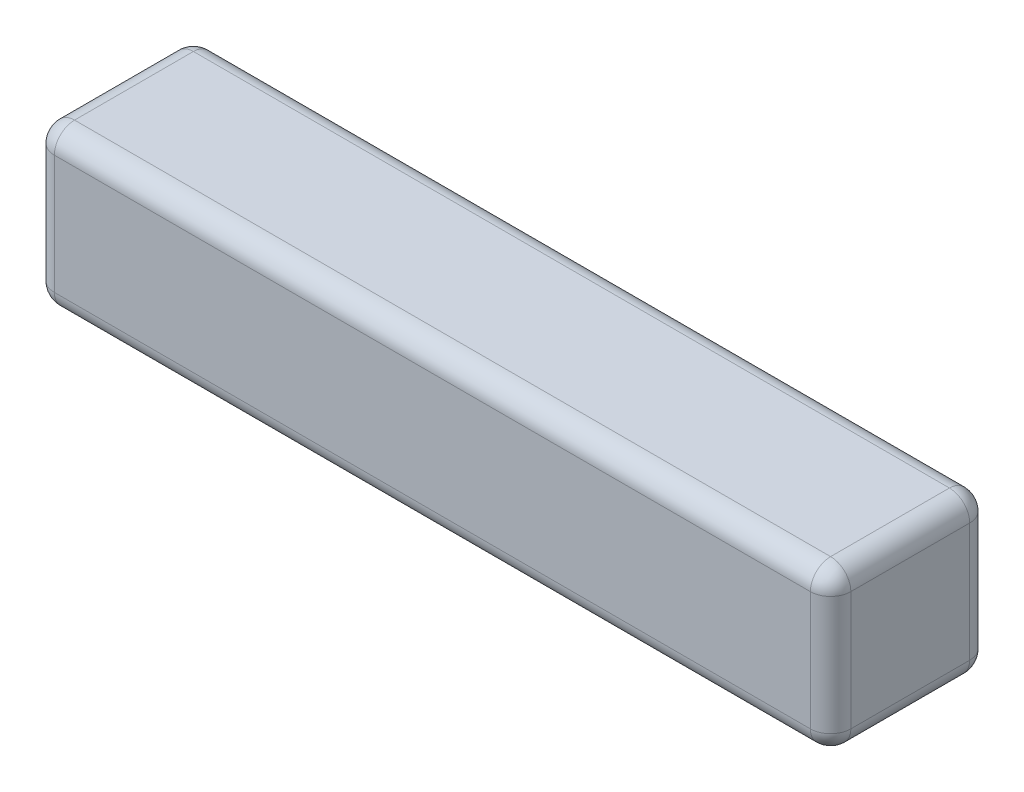
ISO-10303-21;
HEADER;
FILE_DESCRIPTION(('STEP AP214'),'2;1');
FILE_NAME('part.step','',(''),(''),'','','');
FILE_SCHEMA(('AUTOMOTIVE_DESIGN { 1 0 10303 214 1 1 1 1 }'));
ENDSEC;
DATA;
#1=APPLICATION_CONTEXT('core data for automotive mechanical design processes');
#2=APPLICATION_PROTOCOL_DEFINITION('international standard','automotive_design',2000,#1);
#3=PRODUCT_CONTEXT('',#1,'mechanical');
#4=PRODUCT('Part','Part','',(#3));
#5=PRODUCT_RELATED_PRODUCT_CATEGORY('part','',(#4));
#6=PRODUCT_DEFINITION_FORMATION('','',#4);
#7=PRODUCT_DEFINITION_CONTEXT('part definition',#1,'design');
#8=PRODUCT_DEFINITION('design','',#6,#7);
#9=PRODUCT_DEFINITION_SHAPE('','',#8);
#10=(LENGTH_UNIT() NAMED_UNIT(*) SI_UNIT(.MILLI.,.METRE.));
#11=(NAMED_UNIT(*) PLANE_ANGLE_UNIT() SI_UNIT($,.RADIAN.));
#12=(NAMED_UNIT(*) SI_UNIT($,.STERADIAN.) SOLID_ANGLE_UNIT());
#13=UNCERTAINTY_MEASURE_WITH_UNIT(LENGTH_MEASURE(1.E-05),#10,'distance_accuracy_value','');
#14=(GEOMETRIC_REPRESENTATION_CONTEXT(3) GLOBAL_UNCERTAINTY_ASSIGNED_CONTEXT((#13)) GLOBAL_UNIT_ASSIGNED_CONTEXT((#10,
#11,#12)) REPRESENTATION_CONTEXT('',''));
#15=CARTESIAN_POINT('',(0.,0.,0.));
#16=DIRECTION('',(0.,0.,1.));
#17=DIRECTION('',(1.,0.,0.));
#18=AXIS2_PLACEMENT_3D('',#15,#16,#17);
#19=CARTESIAN_POINT('',(9.746,-21.0707501147141,-3.74600000000002));
#20=DIRECTION('',(1.,0.,0.));
#21=DIRECTION('',(0.,0.,-1.));
#22=AXIS2_PLACEMENT_3D('',#19,#20,#21);
#23=SPHERICAL_SURFACE('',#22,0.254);
#24=CARTESIAN_POINT('',(9.746,-21.0707501147141,-3.74600000000002));
#25=DIRECTION('',(0.,0.,-1.));
#26=DIRECTION('',(0.,1.,0.));
#27=AXIS2_PLACEMENT_3D('',#24,#25,#26);
#28=CIRCLE('',#27,0.254000000000001);
#29=CARTESIAN_POINT('',(10.,-21.0707501147141,-3.74600000000002));
#30=VERTEX_POINT('',#29);
#31=CARTESIAN_POINT('',(9.746,-20.8167501147141,-3.74600000000001));
#32=VERTEX_POINT('',#31);
#33=EDGE_CURVE('E296',#30,#32,#28,.F.);
#34=ORIENTED_EDGE('',*,*,#33,.F.);
#35=CARTESIAN_POINT('',(9.746,-21.0707501147141,-3.74600000000001));
#36=DIRECTION('',(0.,-1.,0.));
#37=DIRECTION('',(0.,0.,-1.));
#38=AXIS2_PLACEMENT_3D('',#35,#36,#37);
#39=CIRCLE('',#38,0.254);
#40=CARTESIAN_POINT('',(9.746,-21.0707501147141,-4.00000000000002));
#41=VERTEX_POINT('',#40);
#42=EDGE_CURVE('E133',#41,#30,#39,.T.);
#43=ORIENTED_EDGE('',*,*,#42,.F.);
#44=CARTESIAN_POINT('',(9.746,-21.0707501147141,-3.74600000000002));
#45=DIRECTION('',(-1.,0.,0.));
#46=DIRECTION('',(0.,0.,1.));
#47=AXIS2_PLACEMENT_3D('',#44,#45,#46);
#48=CIRCLE('',#47,0.254);
#49=EDGE_CURVE('E103',#32,#41,#48,.T.);
#50=ORIENTED_EDGE('',*,*,#49,.F.);
#51=EDGE_LOOP('',(#34,#43,#50));
#52=FACE_BOUND('',#51,.T.);
#53=ADVANCED_FACE('F16',(#52),#23,.T.);
#54=CARTESIAN_POINT('',(9.746,-22.5627501147141,-3.74600000000002));
#55=DIRECTION('',(1.,0.,0.));
#56=DIRECTION('',(0.,0.,-1.));
#57=AXIS2_PLACEMENT_3D('',#54,#55,#56);
#58=SPHERICAL_SURFACE('',#57,0.254);
#59=CARTESIAN_POINT('',(9.746,-22.5627501147141,-3.74600000000001));
#60=DIRECTION('',(0.,0.,1.));
#61=DIRECTION('',(0.,-1.,0.));
#62=AXIS2_PLACEMENT_3D('',#59,#60,#61);
#63=CIRCLE('',#62,0.254000000000001);
#64=CARTESIAN_POINT('',(9.746,-22.8167501147141,-3.74600000000001));
#65=VERTEX_POINT('',#64);
#66=CARTESIAN_POINT('',(10.,-22.5627501147141,-3.74600000000002));
#67=VERTEX_POINT('',#66);
#68=EDGE_CURVE('E288',#65,#67,#63,.T.);
#69=ORIENTED_EDGE('',*,*,#68,.F.);
#70=CARTESIAN_POINT('',(9.746,-22.5627501147141,-3.74600000000002));
#71=DIRECTION('',(-1.,0.,0.));
#72=DIRECTION('',(0.,0.,1.));
#73=AXIS2_PLACEMENT_3D('',#70,#71,#72);
#74=CIRCLE('',#73,0.254);
#75=CARTESIAN_POINT('',(9.746,-22.5627501147141,-4.00000000000001));
#76=VERTEX_POINT('',#75);
#77=EDGE_CURVE('E287',#76,#65,#74,.T.);
#78=ORIENTED_EDGE('',*,*,#77,.F.);
#79=CARTESIAN_POINT('',(9.746,-22.5627501147141,-3.74600000000001));
#80=DIRECTION('',(0.,-1.,0.));
#81=DIRECTION('',(0.,0.,-1.));
#82=AXIS2_PLACEMENT_3D('',#79,#80,#81);
#83=CIRCLE('',#82,0.254);
#84=EDGE_CURVE('E283',#67,#76,#83,.F.);
#85=ORIENTED_EDGE('',*,*,#84,.F.);
#86=EDGE_LOOP('',(#69,#78,#85));
#87=FACE_BOUND('',#86,.T.);
#88=ADVANCED_FACE('F154',(#87),#58,.T.);
#89=CARTESIAN_POINT('',(10.,-20.8167501147141,-4.00000000000002));
#90=DIRECTION('',(0.,0.,1.));
#91=DIRECTION('',(0.,-1.,0.));
#92=AXIS2_PLACEMENT_3D('',#89,#90,#91);
#93=PLANE('',#92);
#94=DIRECTION('',(-1.,0.,0.));
#95=VECTOR('',#94,1.);
#96=CARTESIAN_POINT('',(10.,-22.5627501147141,-4.00000000000002));
#97=LINE('',#96,#95);
#98=CARTESIAN_POINT('',(0.254000000000004,-22.5627501147141,-4.00000000000002));
#99=VERTEX_POINT('',#98);
#100=EDGE_CURVE('E116',#99,#76,#97,.F.);
#101=ORIENTED_EDGE('',*,*,#100,.F.);
#102=DIRECTION('',(0.,-1.,0.));
#103=VECTOR('',#102,1.);
#104=CARTESIAN_POINT('',(0.254000000000004,-20.8167501147141,-4.00000000000002));
#105=LINE('',#104,#103);
#106=CARTESIAN_POINT('',(0.254000000000004,-21.0707501147141,-4.00000000000002));
#107=VERTEX_POINT('',#106);
#108=EDGE_CURVE('E110',#107,#99,#105,.T.);
#109=ORIENTED_EDGE('',*,*,#108,.F.);
#110=DIRECTION('',(-1.,0.,0.));
#111=VECTOR('',#110,1.);
#112=CARTESIAN_POINT('',(10.,-21.0707501147141,-4.00000000000002));
#113=LINE('',#112,#111);
#114=EDGE_CURVE('E114',#41,#107,#113,.T.);
#115=ORIENTED_EDGE('',*,*,#114,.F.);
#116=DIRECTION('',(0.,-1.,0.));
#117=VECTOR('',#116,1.);
#118=CARTESIAN_POINT('',(9.746,-22.8167501147141,-4.00000000000001));
#119=LINE('',#118,#117);
#120=EDGE_CURVE('E285',#76,#41,#119,.F.);
#121=ORIENTED_EDGE('',*,*,#120,.F.);
#122=EDGE_LOOP('',(#101,#109,#115,#121));
#123=FACE_BOUND('',#122,.T.);
#124=ADVANCED_FACE('F112',(#123),#93,.F.);
#125=CARTESIAN_POINT('',(0.254000000000004,-21.0707501147141,-3.74600000000002));
#126=DIRECTION('',(1.,0.,0.));
#127=DIRECTION('',(0.,0.,-1.));
#128=AXIS2_PLACEMENT_3D('',#125,#126,#127);
#129=SPHERICAL_SURFACE('',#128,0.254);
#130=CARTESIAN_POINT('',(0.254000000000004,-21.0707501147141,-3.74600000000002));
#131=DIRECTION('',(-1.,0.,0.));
#132=DIRECTION('',(0.,0.,1.));
#133=AXIS2_PLACEMENT_3D('',#130,#131,#132);
#134=CIRCLE('',#133,0.254);
#135=CARTESIAN_POINT('',(0.254000000000004,-20.8167501147141,-3.74600000000001));
#136=VERTEX_POINT('',#135);
#137=EDGE_CURVE('E118',#107,#136,#134,.F.);
#138=ORIENTED_EDGE('',*,*,#137,.F.);
#139=CARTESIAN_POINT('',(0.254000000000004,-21.0707501147141,-3.74600000000001));
#140=DIRECTION('',(0.,1.,0.));
#141=DIRECTION('',(0.,0.,1.));
#142=AXIS2_PLACEMENT_3D('',#139,#140,#141);
#143=CIRCLE('',#142,0.254);
#144=CARTESIAN_POINT('',(0.,-21.0707501147141,-3.74600000000001));
#145=VERTEX_POINT('',#144);
#146=EDGE_CURVE('E122',#145,#107,#143,.F.);
#147=ORIENTED_EDGE('',*,*,#146,.F.);
#148=CARTESIAN_POINT('',(0.254000000000004,-21.0707501147141,-3.74600000000001));
#149=DIRECTION('',(0.,0.,1.));
#150=DIRECTION('',(0.,-1.,0.));
#151=AXIS2_PLACEMENT_3D('',#148,#149,#150);
#152=CIRCLE('',#151,0.254);
#153=EDGE_CURVE('E136',#136,#145,#152,.T.);
#154=ORIENTED_EDGE('',*,*,#153,.F.);
#155=EDGE_LOOP('',(#138,#147,#154));
#156=FACE_BOUND('',#155,.T.);
#157=ADVANCED_FACE('F135',(#156),#129,.T.);
#158=CARTESIAN_POINT('',(0.254000000000004,-22.5627501147141,-3.74600000000002));
#159=DIRECTION('',(1.,0.,0.));
#160=DIRECTION('',(0.,0.,-1.));
#161=AXIS2_PLACEMENT_3D('',#158,#159,#160);
#162=SPHERICAL_SURFACE('',#161,0.254);
#163=CARTESIAN_POINT('',(0.254000000000004,-22.5627501147141,-3.74600000000001));
#164=DIRECTION('',(0.,1.,0.));
#165=DIRECTION('',(0.,0.,1.));
#166=AXIS2_PLACEMENT_3D('',#163,#164,#165);
#167=CIRCLE('',#166,0.254);
#168=CARTESIAN_POINT('',(0.,-22.5627501147141,-3.74600000000002));
#169=VERTEX_POINT('',#168);
#170=EDGE_CURVE('E129',#99,#169,#167,.T.);
#171=ORIENTED_EDGE('',*,*,#170,.F.);
#172=CARTESIAN_POINT('',(0.254000000000004,-22.5627501147141,-3.74600000000002));
#173=DIRECTION('',(-1.,0.,0.));
#174=DIRECTION('',(0.,0.,1.));
#175=AXIS2_PLACEMENT_3D('',#172,#173,#174);
#176=CIRCLE('',#175,0.254);
#177=CARTESIAN_POINT('',(0.254000000000004,-22.8167501147141,-3.74600000000001));
#178=VERTEX_POINT('',#177);
#179=EDGE_CURVE('E291',#178,#99,#176,.F.);
#180=ORIENTED_EDGE('',*,*,#179,.F.);
#181=CARTESIAN_POINT('',(0.254000000000004,-22.5627501147141,-3.74600000000002));
#182=DIRECTION('',(0.,0.,-1.));
#183=DIRECTION('',(0.,1.,0.));
#184=AXIS2_PLACEMENT_3D('',#181,#182,#183);
#185=CIRCLE('',#184,0.254);
#186=EDGE_CURVE('E130',#169,#178,#185,.F.);
#187=ORIENTED_EDGE('',*,*,#186,.F.);
#188=EDGE_LOOP('',(#171,#180,#187));
#189=FACE_BOUND('',#188,.T.);
#190=ADVANCED_FACE('F145',(#189),#162,.T.);
#191=CARTESIAN_POINT('',(10.,-21.0707501147141,-3.74600000000002));
#192=DIRECTION('',(-1.,0.,0.));
#193=DIRECTION('',(0.,0.,1.));
#194=AXIS2_PLACEMENT_3D('',#191,#192,#193);
#195=CYLINDRICAL_SURFACE('',#194,0.254);
#196=ORIENTED_EDGE('',*,*,#49,.T.);
#197=ORIENTED_EDGE('',*,*,#114,.T.);
#198=ORIENTED_EDGE('',*,*,#137,.T.);
#199=DIRECTION('',(1.,0.,0.));
#200=VECTOR('',#199,1.);
#201=CARTESIAN_POINT('',(10.,-20.8167501147141,-3.74600000000001));
#202=LINE('',#201,#200);
#203=EDGE_CURVE('E378',#136,#32,#202,.T.);
#204=ORIENTED_EDGE('',*,*,#203,.T.);
#205=EDGE_LOOP('',(#196,#197,#198,#204));
#206=FACE_BOUND('',#205,.T.);
#207=ADVANCED_FACE('F132',(#206),#195,.T.);
#208=CARTESIAN_POINT('',(9.746,-22.8167501147141,-3.74600000000001));
#209=DIRECTION('',(0.,-1.,0.));
#210=DIRECTION('',(0.,0.,-1.));
#211=AXIS2_PLACEMENT_3D('',#208,#209,#210);
#212=CYLINDRICAL_SURFACE('',#211,0.254);
#213=ORIENTED_EDGE('',*,*,#84,.T.);
#214=ORIENTED_EDGE('',*,*,#120,.T.);
#215=ORIENTED_EDGE('',*,*,#42,.T.);
#216=DIRECTION('',(0.,1.,0.));
#217=VECTOR('',#216,1.);
#218=CARTESIAN_POINT('',(10.,-22.8167501147141,-3.74600000000002));
#219=LINE('',#218,#217);
#220=EDGE_CURVE('E235',#67,#30,#219,.T.);
#221=ORIENTED_EDGE('',*,*,#220,.F.);
#222=EDGE_LOOP('',(#213,#214,#215,#221));
#223=FACE_BOUND('',#222,.T.);
#224=ADVANCED_FACE('F273',(#223),#212,.T.);
#225=CARTESIAN_POINT('',(9.746,-21.0707501147141,-2.00000000000002));
#226=DIRECTION('',(0.,0.,-1.));
#227=DIRECTION('',(0.,1.,0.));
#228=AXIS2_PLACEMENT_3D('',#225,#226,#227);
#229=CYLINDRICAL_SURFACE('',#228,0.254000000000001);
#230=ORIENTED_EDGE('',*,*,#33,.T.);
#231=DIRECTION('',(0.,0.,-1.));
#232=VECTOR('',#231,1.);
#233=CARTESIAN_POINT('',(9.746,-20.8167501147141,-2.00000000000002));
#234=LINE('',#233,#232);
#235=CARTESIAN_POINT('',(9.746,-20.8167501147141,-2.25400000000001));
#236=VERTEX_POINT('',#235);
#237=EDGE_CURVE('E310',#32,#236,#234,.F.);
#238=ORIENTED_EDGE('',*,*,#237,.T.);
#239=CARTESIAN_POINT('',(9.746,-21.0707501147141,-2.25400000000001));
#240=DIRECTION('',(0.,0.,1.));
#241=DIRECTION('',(1.,0.,0.));
#242=AXIS2_PLACEMENT_3D('',#239,#240,#241);
#243=CIRCLE('',#242,0.254);
#244=CARTESIAN_POINT('',(10.,-21.0707501147141,-2.25400000000001));
#245=VERTEX_POINT('',#244);
#246=EDGE_CURVE('E241',#245,#236,#243,.T.);
#247=ORIENTED_EDGE('',*,*,#246,.F.);
#248=DIRECTION('',(0.,0.,-1.));
#249=VECTOR('',#248,1.);
#250=CARTESIAN_POINT('',(10.,-21.0707501147141,-2.00000000000001));
#251=LINE('',#250,#249);
#252=EDGE_CURVE('E233',#30,#245,#251,.F.);
#253=ORIENTED_EDGE('',*,*,#252,.F.);
#254=EDGE_LOOP('',(#230,#238,#247,#253));
#255=FACE_BOUND('',#254,.T.);
#256=ADVANCED_FACE('F270',(#255),#229,.T.);
#257=CARTESIAN_POINT('',(9.746,-22.5627501147141,-2.00000000000001));
#258=DIRECTION('',(0.,0.,1.));
#259=DIRECTION('',(0.,-1.,0.));
#260=AXIS2_PLACEMENT_3D('',#257,#258,#259);
#261=CYLINDRICAL_SURFACE('',#260,0.254000000000001);
#262=ORIENTED_EDGE('',*,*,#68,.T.);
#263=DIRECTION('',(0.,0.,-1.));
#264=VECTOR('',#263,1.);
#265=CARTESIAN_POINT('',(10.,-22.5627501147141,-2.00000000000001));
#266=LINE('',#265,#264);
#267=CARTESIAN_POINT('',(10.,-22.5627501147141,-2.25400000000001));
#268=VERTEX_POINT('',#267);
#269=EDGE_CURVE('E238',#268,#67,#266,.T.);
#270=ORIENTED_EDGE('',*,*,#269,.F.);
#271=CARTESIAN_POINT('',(9.746,-22.5627501147141,-2.25400000000001));
#272=DIRECTION('',(0.,0.,-1.));
#273=DIRECTION('',(1.,0.,0.));
#274=AXIS2_PLACEMENT_3D('',#271,#272,#273);
#275=CIRCLE('',#274,0.254);
#276=CARTESIAN_POINT('',(9.746,-22.8167501147141,-2.25400000000001));
#277=VERTEX_POINT('',#276);
#278=EDGE_CURVE('E231',#277,#268,#275,.F.);
#279=ORIENTED_EDGE('',*,*,#278,.F.);
#280=DIRECTION('',(0.,0.,1.));
#281=VECTOR('',#280,1.);
#282=CARTESIAN_POINT('',(9.746,-22.8167501147141,-2.00000000000001));
#283=LINE('',#282,#281);
#284=EDGE_CURVE('E229',#277,#65,#283,.F.);
#285=ORIENTED_EDGE('',*,*,#284,.T.);
#286=EDGE_LOOP('',(#262,#270,#279,#285));
#287=FACE_BOUND('',#286,.T.);
#288=ADVANCED_FACE('F266',(#287),#261,.T.);
#289=CARTESIAN_POINT('',(10.,-22.5627501147141,-3.74600000000002));
#290=DIRECTION('',(-1.,0.,0.));
#291=DIRECTION('',(0.,0.,1.));
#292=AXIS2_PLACEMENT_3D('',#289,#290,#291);
#293=CYLINDRICAL_SURFACE('',#292,0.254);
#294=ORIENTED_EDGE('',*,*,#179,.T.);
#295=ORIENTED_EDGE('',*,*,#100,.T.);
#296=ORIENTED_EDGE('',*,*,#77,.T.);
#297=DIRECTION('',(1.,0.,0.));
#298=VECTOR('',#297,1.);
#299=CARTESIAN_POINT('',(10.,-22.8167501147141,-3.74600000000001));
#300=LINE('',#299,#298);
#301=EDGE_CURVE('E373',#65,#178,#300,.F.);
#302=ORIENTED_EDGE('',*,*,#301,.T.);
#303=EDGE_LOOP('',(#294,#295,#296,#302));
#304=FACE_BOUND('',#303,.T.);
#305=ADVANCED_FACE('F262',(#304),#293,.T.);
#306=CARTESIAN_POINT('',(0.254000000000004,-21.0707501147141,-2.00000000000002));
#307=DIRECTION('',(0.,0.,1.));
#308=DIRECTION('',(0.,-1.,0.));
#309=AXIS2_PLACEMENT_3D('',#306,#307,#308);
#310=CYLINDRICAL_SURFACE('',#309,0.254);
#311=ORIENTED_EDGE('',*,*,#153,.T.);
#312=DIRECTION('',(0.,0.,-1.));
#313=VECTOR('',#312,1.);
#314=CARTESIAN_POINT('',(0.,-21.0707501147141,-2.00000000000001));
#315=LINE('',#314,#313);
#316=CARTESIAN_POINT('',(0.,-21.0707501147141,-2.25400000000001));
#317=VERTEX_POINT('',#316);
#318=EDGE_CURVE('E204',#145,#317,#315,.F.);
#319=ORIENTED_EDGE('',*,*,#318,.T.);
#320=CARTESIAN_POINT('',(0.254000000000004,-21.0707501147141,-2.25400000000001));
#321=DIRECTION('',(0.,0.,1.));
#322=DIRECTION('',(1.,0.,0.));
#323=AXIS2_PLACEMENT_3D('',#320,#321,#322);
#324=CIRCLE('',#323,0.254);
#325=CARTESIAN_POINT('',(0.254000000000004,-20.8167501147141,-2.25400000000001));
#326=VERTEX_POINT('',#325);
#327=EDGE_CURVE('E207',#326,#317,#324,.T.);
#328=ORIENTED_EDGE('',*,*,#327,.F.);
#329=DIRECTION('',(0.,0.,-1.));
#330=VECTOR('',#329,1.);
#331=CARTESIAN_POINT('',(0.254000000000004,-20.8167501147141,-2.00000000000002));
#332=LINE('',#331,#330);
#333=EDGE_CURVE('E376',#326,#136,#332,.T.);
#334=ORIENTED_EDGE('',*,*,#333,.T.);
#335=EDGE_LOOP('',(#311,#319,#328,#334));
#336=FACE_BOUND('',#335,.T.);
#337=ADVANCED_FACE('F258',(#336),#310,.T.);
#338=CARTESIAN_POINT('',(0.254000000000004,-22.5627501147141,-2.00000000000001));
#339=DIRECTION('',(0.,0.,-1.));
#340=DIRECTION('',(0.,1.,0.));
#341=AXIS2_PLACEMENT_3D('',#338,#339,#340);
#342=CYLINDRICAL_SURFACE('',#341,0.254);
#343=ORIENTED_EDGE('',*,*,#186,.T.);
#344=DIRECTION('',(0.,0.,1.));
#345=VECTOR('',#344,1.);
#346=CARTESIAN_POINT('',(0.254000000000004,-22.8167501147141,-2.00000000000001));
#347=LINE('',#346,#345);
#348=CARTESIAN_POINT('',(0.254000000000004,-22.8167501147141,-2.25400000000001));
#349=VERTEX_POINT('',#348);
#350=EDGE_CURVE('E367',#178,#349,#347,.T.);
#351=ORIENTED_EDGE('',*,*,#350,.T.);
#352=CARTESIAN_POINT('',(0.254000000000004,-22.5627501147141,-2.25400000000001));
#353=DIRECTION('',(0.,0.,-1.));
#354=DIRECTION('',(0.,1.,0.));
#355=AXIS2_PLACEMENT_3D('',#352,#353,#354);
#356=CIRCLE('',#355,0.254);
#357=CARTESIAN_POINT('',(0.,-22.5627501147141,-2.25400000000001));
#358=VERTEX_POINT('',#357);
#359=EDGE_CURVE('E365',#349,#358,#356,.T.);
#360=ORIENTED_EDGE('',*,*,#359,.T.);
#361=DIRECTION('',(0.,0.,-1.));
#362=VECTOR('',#361,1.);
#363=CARTESIAN_POINT('',(0.,-22.5627501147141,-2.00000000000001));
#364=LINE('',#363,#362);
#365=EDGE_CURVE('E201',#358,#169,#364,.T.);
#366=ORIENTED_EDGE('',*,*,#365,.T.);
#367=EDGE_LOOP('',(#343,#351,#360,#366));
#368=FACE_BOUND('',#367,.T.);
#369=ADVANCED_FACE('F255',(#368),#342,.T.);
#370=CARTESIAN_POINT('',(0.254000000000004,-20.8167501147141,-3.74600000000001));
#371=DIRECTION('',(0.,1.,0.));
#372=DIRECTION('',(0.,0.,1.));
#373=AXIS2_PLACEMENT_3D('',#370,#371,#372);
#374=CYLINDRICAL_SURFACE('',#373,0.254);
#375=ORIENTED_EDGE('',*,*,#170,.T.);
#376=DIRECTION('',(0.,1.,0.));
#377=VECTOR('',#376,1.);
#378=CARTESIAN_POINT('',(0.,-22.8167501147141,-3.74600000000002));
#379=LINE('',#378,#377);
#380=EDGE_CURVE('E125',#169,#145,#379,.T.);
#381=ORIENTED_EDGE('',*,*,#380,.T.);
#382=ORIENTED_EDGE('',*,*,#146,.T.);
#383=ORIENTED_EDGE('',*,*,#108,.T.);
#384=EDGE_LOOP('',(#375,#381,#382,#383));
#385=FACE_BOUND('',#384,.T.);
#386=ADVANCED_FACE('F123',(#385),#374,.T.);
#387=CARTESIAN_POINT('',(10.,-20.8167501147141,-2.00000000000002));
#388=DIRECTION('',(0.,-1.,0.));
#389=DIRECTION('',(0.,0.,-1.));
#390=AXIS2_PLACEMENT_3D('',#387,#388,#389);
#391=PLANE('',#390);
#392=ORIENTED_EDGE('',*,*,#203,.F.);
#393=ORIENTED_EDGE('',*,*,#333,.F.);
#394=DIRECTION('',(-1.,0.,0.));
#395=VECTOR('',#394,1.);
#396=CARTESIAN_POINT('',(10.,-20.8167501147141,-2.25400000000002));
#397=LINE('',#396,#395);
#398=EDGE_CURVE('E327',#236,#326,#397,.T.);
#399=ORIENTED_EDGE('',*,*,#398,.F.);
#400=ORIENTED_EDGE('',*,*,#237,.F.);
#401=EDGE_LOOP('',(#392,#393,#399,#400));
#402=FACE_BOUND('',#401,.T.);
#403=ADVANCED_FACE('F248',(#402),#391,.F.);
#404=CARTESIAN_POINT('',(9.746,-21.0707501147141,-2.25400000000001));
#405=DIRECTION('',(1.,0.,0.));
#406=DIRECTION('',(0.,0.,-1.));
#407=AXIS2_PLACEMENT_3D('',#404,#405,#406);
#408=SPHERICAL_SURFACE('',#407,0.254);
#409=CARTESIAN_POINT('',(9.746,-21.0707501147141,-2.25400000000001));
#410=DIRECTION('',(-1.,0.,0.));
#411=DIRECTION('',(0.,0.,1.));
#412=AXIS2_PLACEMENT_3D('',#409,#410,#411);
#413=CIRCLE('',#412,0.254);
#414=CARTESIAN_POINT('',(9.746,-21.0707501147141,-2.00000000000001));
#415=VERTEX_POINT('',#414);
#416=EDGE_CURVE('E198',#415,#236,#413,.T.);
#417=ORIENTED_EDGE('',*,*,#416,.F.);
#418=CARTESIAN_POINT('',(9.746,-21.0707501147141,-2.25400000000001));
#419=DIRECTION('',(0.,1.,0.));
#420=DIRECTION('',(0.,0.,1.));
#421=AXIS2_PLACEMENT_3D('',#418,#419,#420);
#422=CIRCLE('',#421,0.254);
#423=EDGE_CURVE('E318',#245,#415,#422,.F.);
#424=ORIENTED_EDGE('',*,*,#423,.F.);
#425=ORIENTED_EDGE('',*,*,#246,.T.);
#426=EDGE_LOOP('',(#417,#424,#425));
#427=FACE_BOUND('',#426,.T.);
#428=ADVANCED_FACE('F245',(#427),#408,.T.);
#429=CARTESIAN_POINT('',(10.,-22.8167501147141,-2.00000000000001));
#430=DIRECTION('',(1.,0.,0.));
#431=DIRECTION('',(0.,0.,-1.));
#432=AXIS2_PLACEMENT_3D('',#429,#430,#431);
#433=PLANE('',#432);
#434=ORIENTED_EDGE('',*,*,#252,.T.);
#435=DIRECTION('',(0.,1.,0.));
#436=VECTOR('',#435,1.);
#437=CARTESIAN_POINT('',(10.,-22.8167501147141,-2.25400000000001));
#438=LINE('',#437,#436);
#439=EDGE_CURVE('E316',#268,#245,#438,.T.);
#440=ORIENTED_EDGE('',*,*,#439,.F.);
#441=ORIENTED_EDGE('',*,*,#269,.T.);
#442=ORIENTED_EDGE('',*,*,#220,.T.);
#443=EDGE_LOOP('',(#434,#440,#441,#442));
#444=FACE_BOUND('',#443,.T.);
#445=ADVANCED_FACE('F223',(#444),#433,.T.);
#446=CARTESIAN_POINT('',(9.746,-22.5627501147141,-2.25400000000001));
#447=DIRECTION('',(1.,0.,0.));
#448=DIRECTION('',(0.,0.,-1.));
#449=AXIS2_PLACEMENT_3D('',#446,#447,#448);
#450=SPHERICAL_SURFACE('',#449,0.254);
#451=CARTESIAN_POINT('',(9.746,-22.5627501147141,-2.25400000000001));
#452=DIRECTION('',(-1.,0.,0.));
#453=DIRECTION('',(0.,0.,1.));
#454=AXIS2_PLACEMENT_3D('',#451,#452,#453);
#455=CIRCLE('',#454,0.254);
#456=CARTESIAN_POINT('',(9.746,-22.5627501147018,-2.00000000000001));
#457=VERTEX_POINT('',#456);
#458=EDGE_CURVE('E321',#277,#457,#455,.T.);
#459=ORIENTED_EDGE('',*,*,#458,.F.);
#460=ORIENTED_EDGE('',*,*,#278,.T.);
#461=CARTESIAN_POINT('',(9.746,-22.5627501147141,-2.25400000000001));
#462=DIRECTION('',(0.,1.,0.));
#463=DIRECTION('',(0.,0.,1.));
#464=AXIS2_PLACEMENT_3D('',#461,#462,#463);
#465=CIRCLE('',#464,0.254);
#466=EDGE_CURVE('E320',#457,#268,#465,.T.);
#467=ORIENTED_EDGE('',*,*,#466,.F.);
#468=EDGE_LOOP('',(#459,#460,#467));
#469=FACE_BOUND('',#468,.T.);
#470=ADVANCED_FACE('F218',(#469),#450,.T.);
#471=CARTESIAN_POINT('',(10.,-22.8167501147141,-2.00000000000001));
#472=DIRECTION('',(0.,1.,0.));
#473=DIRECTION('',(0.,0.,1.));
#474=AXIS2_PLACEMENT_3D('',#471,#472,#473);
#475=PLANE('',#474);
#476=ORIENTED_EDGE('',*,*,#301,.F.);
#477=ORIENTED_EDGE('',*,*,#284,.F.);
#478=DIRECTION('',(-1.,0.,0.));
#479=VECTOR('',#478,1.);
#480=CARTESIAN_POINT('',(10.,-22.8167501147141,-2.25400000000001));
#481=LINE('',#480,#479);
#482=EDGE_CURVE('E348',#349,#277,#481,.F.);
#483=ORIENTED_EDGE('',*,*,#482,.F.);
#484=ORIENTED_EDGE('',*,*,#350,.F.);
#485=EDGE_LOOP('',(#476,#477,#483,#484));
#486=FACE_BOUND('',#485,.T.);
#487=ADVANCED_FACE('F214',(#486),#475,.F.);
#488=CARTESIAN_POINT('',(0.254000000000004,-21.0707501147141,-2.25400000000001));
#489=DIRECTION('',(1.,0.,0.));
#490=DIRECTION('',(0.,0.,-1.));
#491=AXIS2_PLACEMENT_3D('',#488,#489,#490);
#492=SPHERICAL_SURFACE('',#491,0.254);
#493=CARTESIAN_POINT('',(0.254000000000004,-21.0707501147141,-2.25400000000001));
#494=DIRECTION('',(-1.,0.,0.));
#495=DIRECTION('',(0.,0.,1.));
#496=AXIS2_PLACEMENT_3D('',#493,#494,#495);
#497=CIRCLE('',#496,0.254);
#498=CARTESIAN_POINT('',(0.254000000000004,-21.0707501147018,-2.00000000000001));
#499=VERTEX_POINT('',#498);
#500=EDGE_CURVE('E324',#326,#499,#497,.F.);
#501=ORIENTED_EDGE('',*,*,#500,.F.);
#502=ORIENTED_EDGE('',*,*,#327,.T.);
#503=CARTESIAN_POINT('',(0.254000000000004,-21.0707501147141,-2.25400000000002));
#504=DIRECTION('',(0.,-1.,0.));
#505=DIRECTION('',(0.,0.,-1.));
#506=AXIS2_PLACEMENT_3D('',#503,#504,#505);
#507=CIRCLE('',#506,0.254);
#508=EDGE_CURVE('E345',#499,#317,#507,.T.);
#509=ORIENTED_EDGE('',*,*,#508,.F.);
#510=EDGE_LOOP('',(#501,#502,#509));
#511=FACE_BOUND('',#510,.T.);
#512=ADVANCED_FACE('F211',(#511),#492,.T.);
#513=CARTESIAN_POINT('',(0.,-22.8167501147141,-2.00000000000001));
#514=DIRECTION('',(1.,0.,0.));
#515=DIRECTION('',(0.,0.,-1.));
#516=AXIS2_PLACEMENT_3D('',#513,#514,#515);
#517=PLANE('',#516);
#518=ORIENTED_EDGE('',*,*,#365,.F.);
#519=DIRECTION('',(0.,-1.,0.));
#520=VECTOR('',#519,1.);
#521=CARTESIAN_POINT('',(0.,-20.8167501147141,-2.25400000000001));
#522=LINE('',#521,#520);
#523=EDGE_CURVE('E340',#317,#358,#522,.T.);
#524=ORIENTED_EDGE('',*,*,#523,.F.);
#525=ORIENTED_EDGE('',*,*,#318,.F.);
#526=ORIENTED_EDGE('',*,*,#380,.F.);
#527=EDGE_LOOP('',(#518,#524,#525,#526));
#528=FACE_BOUND('',#527,.T.);
#529=ADVANCED_FACE('F192',(#528),#517,.F.);
#530=CARTESIAN_POINT('',(0.254000000000004,-22.5627501147141,-2.25400000000001));
#531=DIRECTION('',(1.,0.,0.));
#532=DIRECTION('',(0.,0.,-1.));
#533=AXIS2_PLACEMENT_3D('',#530,#531,#532);
#534=SPHERICAL_SURFACE('',#533,0.254);
#535=CARTESIAN_POINT('',(0.254000000000004,-22.5627501147141,-2.25400000000002));
#536=DIRECTION('',(0.,-1.,0.));
#537=DIRECTION('',(0.,0.,-1.));
#538=AXIS2_PLACEMENT_3D('',#535,#536,#537);
#539=CIRCLE('',#538,0.254);
#540=CARTESIAN_POINT('',(0.254000000000004,-22.5627501147141,-2.00000000000001));
#541=VERTEX_POINT('',#540);
#542=EDGE_CURVE('E33',#358,#541,#539,.F.);
#543=ORIENTED_EDGE('',*,*,#542,.F.);
#544=ORIENTED_EDGE('',*,*,#359,.F.);
#545=CARTESIAN_POINT('',(0.254000000000004,-22.5627501147141,-2.25400000000001));
#546=DIRECTION('',(-1.,0.,0.));
#547=DIRECTION('',(0.,0.,1.));
#548=AXIS2_PLACEMENT_3D('',#545,#546,#547);
#549=CIRCLE('',#548,0.254);
#550=EDGE_CURVE('E351',#541,#349,#549,.F.);
#551=ORIENTED_EDGE('',*,*,#550,.F.);
#552=EDGE_LOOP('',(#543,#544,#551));
#553=FACE_BOUND('',#552,.T.);
#554=ADVANCED_FACE('F187',(#553),#534,.T.);
#555=CARTESIAN_POINT('',(10.,-21.0707501147141,-2.25400000000001));
#556=DIRECTION('',(-1.,0.,0.));
#557=DIRECTION('',(0.,0.,1.));
#558=AXIS2_PLACEMENT_3D('',#555,#556,#557);
#559=CYLINDRICAL_SURFACE('',#558,0.254);
#560=ORIENTED_EDGE('',*,*,#500,.T.);
#561=DIRECTION('',(1.,0.,0.));
#562=VECTOR('',#561,1.);
#563=CARTESIAN_POINT('',(10.,-21.0707501147141,-2.00000000000002));
#564=LINE('',#563,#562);
#565=EDGE_CURVE('E333',#499,#415,#564,.T.);
#566=ORIENTED_EDGE('',*,*,#565,.T.);
#567=ORIENTED_EDGE('',*,*,#416,.T.);
#568=ORIENTED_EDGE('',*,*,#398,.T.);
#569=EDGE_LOOP('',(#560,#566,#567,#568));
#570=FACE_BOUND('',#569,.T.);
#571=ADVANCED_FACE('F183',(#570),#559,.T.);
#572=CARTESIAN_POINT('',(9.746,-22.8167501147141,-2.25400000000001));
#573=DIRECTION('',(0.,1.,0.));
#574=DIRECTION('',(0.,0.,1.));
#575=AXIS2_PLACEMENT_3D('',#572,#573,#574);
#576=CYLINDRICAL_SURFACE('',#575,0.254);
#577=ORIENTED_EDGE('',*,*,#466,.T.);
#578=ORIENTED_EDGE('',*,*,#439,.T.);
#579=ORIENTED_EDGE('',*,*,#423,.T.);
#580=DIRECTION('',(0.,1.,0.));
#581=VECTOR('',#580,1.);
#582=CARTESIAN_POINT('',(9.746,-20.8167501147141,-2.00000000000002));
#583=LINE('',#582,#581);
#584=EDGE_CURVE('E337',#415,#457,#583,.F.);
#585=ORIENTED_EDGE('',*,*,#584,.T.);
#586=EDGE_LOOP('',(#577,#578,#579,#585));
#587=FACE_BOUND('',#586,.T.);
#588=ADVANCED_FACE('F179',(#587),#576,.T.);
#589=CARTESIAN_POINT('',(10.,-22.5627501147141,-2.25400000000001));
#590=DIRECTION('',(-1.,0.,0.));
#591=DIRECTION('',(0.,0.,1.));
#592=AXIS2_PLACEMENT_3D('',#589,#590,#591);
#593=CYLINDRICAL_SURFACE('',#592,0.254);
#594=ORIENTED_EDGE('',*,*,#550,.T.);
#595=ORIENTED_EDGE('',*,*,#482,.T.);
#596=ORIENTED_EDGE('',*,*,#458,.T.);
#597=DIRECTION('',(1.,0.,0.));
#598=VECTOR('',#597,1.);
#599=CARTESIAN_POINT('',(10.,-22.5627501147141,-2.00000000000002));
#600=LINE('',#599,#598);
#601=EDGE_CURVE('E25',#457,#541,#600,.F.);
#602=ORIENTED_EDGE('',*,*,#601,.T.);
#603=EDGE_LOOP('',(#594,#595,#596,#602));
#604=FACE_BOUND('',#603,.T.);
#605=ADVANCED_FACE('F173',(#604),#593,.T.);
#606=CARTESIAN_POINT('',(0.254000000000004,-20.8167501147141,-2.25400000000002));
#607=DIRECTION('',(0.,-1.,0.));
#608=DIRECTION('',(0.,0.,-1.));
#609=AXIS2_PLACEMENT_3D('',#606,#607,#608);
#610=CYLINDRICAL_SURFACE('',#609,0.254);
#611=ORIENTED_EDGE('',*,*,#542,.T.);
#612=DIRECTION('',(0.,1.,0.));
#613=VECTOR('',#612,1.);
#614=CARTESIAN_POINT('',(0.254000000000004,-20.8167501147141,-2.00000000000002));
#615=LINE('',#614,#613);
#616=EDGE_CURVE('E11',#541,#499,#615,.T.);
#617=ORIENTED_EDGE('',*,*,#616,.T.);
#618=ORIENTED_EDGE('',*,*,#508,.T.);
#619=ORIENTED_EDGE('',*,*,#523,.T.);
#620=EDGE_LOOP('',(#611,#617,#618,#619));
#621=FACE_BOUND('',#620,.T.);
#622=ADVANCED_FACE('F167',(#621),#610,.T.);
#623=CARTESIAN_POINT('',(10.,-20.8167501147141,-2.00000000000002));
#624=DIRECTION('',(0.,0.,-1.));
#625=DIRECTION('',(0.,1.,0.));
#626=AXIS2_PLACEMENT_3D('',#623,#624,#625);
#627=PLANE('',#626);
#628=ORIENTED_EDGE('',*,*,#601,.F.);
#629=ORIENTED_EDGE('',*,*,#584,.F.);
#630=ORIENTED_EDGE('',*,*,#565,.F.);
#631=ORIENTED_EDGE('',*,*,#616,.F.);
#632=EDGE_LOOP('',(#628,#629,#630,#631));
#633=FACE_BOUND('',#632,.T.);
#634=ADVANCED_FACE('F165',(#633),#627,.F.);
#635=CLOSED_SHELL('',(#53,#88,#124,#157,#190,#207,#224,#256,#288,#305,#337,#369,#386,#403,#428,
#445,#470,#487,#512,#529,#554,#571,#588,#605,#622,#634));
#636=MANIFOLD_SOLID_BREP('B1',#635);
#637=ADVANCED_BREP_SHAPE_REPRESENTATION('',(#18,#636),#14);
#638=SHAPE_DEFINITION_REPRESENTATION(#9,#637);
ENDSEC;
END-ISO-10303-21;
